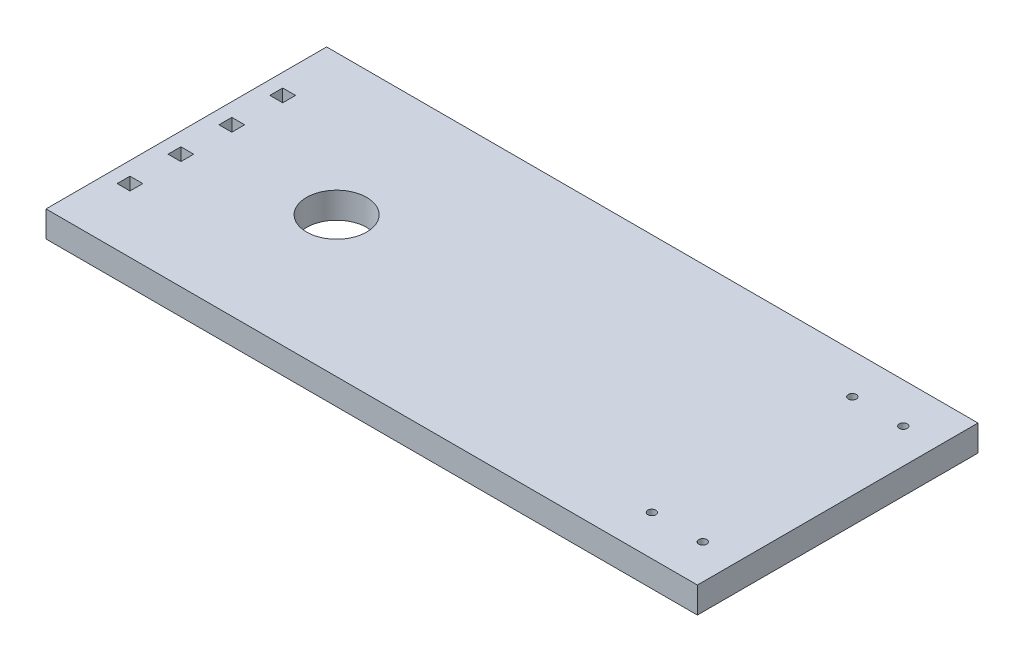
ISO-10303-21;
HEADER;
FILE_DESCRIPTION(('STEP AP214'),'2;1');
FILE_NAME('part.step','',(''),(''),'','','');
FILE_SCHEMA(('AUTOMOTIVE_DESIGN { 1 0 10303 214 1 1 1 1 }'));
ENDSEC;
DATA;
#1=APPLICATION_CONTEXT('core data for automotive mechanical design processes');
#2=APPLICATION_PROTOCOL_DEFINITION('international standard','automotive_design',2000,#1);
#3=PRODUCT_CONTEXT('',#1,'mechanical');
#4=PRODUCT('Part','Part','',(#3));
#5=PRODUCT_RELATED_PRODUCT_CATEGORY('part','',(#4));
#6=PRODUCT_DEFINITION_FORMATION('','',#4);
#7=PRODUCT_DEFINITION_CONTEXT('part definition',#1,'design');
#8=PRODUCT_DEFINITION('design','',#6,#7);
#9=PRODUCT_DEFINITION_SHAPE('','',#8);
#10=(LENGTH_UNIT() NAMED_UNIT(*) SI_UNIT(.MILLI.,.METRE.));
#11=(NAMED_UNIT(*) PLANE_ANGLE_UNIT() SI_UNIT($,.RADIAN.));
#12=(NAMED_UNIT(*) SI_UNIT($,.STERADIAN.) SOLID_ANGLE_UNIT());
#13=UNCERTAINTY_MEASURE_WITH_UNIT(LENGTH_MEASURE(1.E-05),#10,'distance_accuracy_value','');
#14=(GEOMETRIC_REPRESENTATION_CONTEXT(3) GLOBAL_UNCERTAINTY_ASSIGNED_CONTEXT((#13)) GLOBAL_UNIT_ASSIGNED_CONTEXT((#10,
#11,#12)) REPRESENTATION_CONTEXT('',''));
#15=CARTESIAN_POINT('',(0.,0.,0.));
#16=DIRECTION('',(0.,0.,1.));
#17=DIRECTION('',(1.,0.,0.));
#18=AXIS2_PLACEMENT_3D('',#15,#16,#17);
#19=CARTESIAN_POINT('',(16.25,1.3,7.));
#20=DIRECTION('',(-1.,0.,0.));
#21=DIRECTION('',(0.,0.,1.));
#22=AXIS2_PLACEMENT_3D('',#19,#20,#21);
#23=PLANE('',#22);
#24=DIRECTION('',(0.,0.,-1.));
#25=VECTOR('',#24,1.);
#26=CARTESIAN_POINT('',(16.25,0.,7.));
#27=LINE('',#26,#25);
#28=CARTESIAN_POINT('',(16.25,0.,7.));
#29=VERTEX_POINT('',#28);
#30=CARTESIAN_POINT('',(16.25,0.,-7.));
#31=VERTEX_POINT('',#30);
#32=EDGE_CURVE('E326',#29,#31,#27,.T.);
#33=ORIENTED_EDGE('',*,*,#32,.T.);
#34=DIRECTION('',(0.,-1.,0.));
#35=VECTOR('',#34,1.);
#36=CARTESIAN_POINT('',(16.25,1.3,-7.));
#37=LINE('',#36,#35);
#38=CARTESIAN_POINT('',(16.25,1.3,-7.));
#39=VERTEX_POINT('',#38);
#40=EDGE_CURVE('E11',#39,#31,#37,.T.);
#41=ORIENTED_EDGE('',*,*,#40,.F.);
#42=DIRECTION('',(0.,0.,-1.));
#43=VECTOR('',#42,1.);
#44=CARTESIAN_POINT('',(16.25,1.3,7.));
#45=LINE('',#44,#43);
#46=CARTESIAN_POINT('',(16.25,1.3,7.));
#47=VERTEX_POINT('',#46);
#48=EDGE_CURVE('E329',#47,#39,#45,.T.);
#49=ORIENTED_EDGE('',*,*,#48,.F.);
#50=DIRECTION('',(0.,-1.,0.));
#51=VECTOR('',#50,1.);
#52=CARTESIAN_POINT('',(16.25,1.3,7.));
#53=LINE('',#52,#51);
#54=EDGE_CURVE('E339',#47,#29,#53,.T.);
#55=ORIENTED_EDGE('',*,*,#54,.T.);
#56=EDGE_LOOP('',(#33,#41,#49,#55));
#57=FACE_BOUND('',#56,.T.);
#58=ADVANCED_FACE('F33',(#57),#23,.F.);
#59=CARTESIAN_POINT('',(-16.25,1.3,-7.));
#60=DIRECTION('',(0.,0.,1.));
#61=DIRECTION('',(1.,0.,0.));
#62=AXIS2_PLACEMENT_3D('',#59,#60,#61);
#63=PLANE('',#62);
#64=DIRECTION('',(-1.,0.,0.));
#65=VECTOR('',#64,1.);
#66=CARTESIAN_POINT('',(-16.25,0.,-7.));
#67=LINE('',#66,#65);
#68=CARTESIAN_POINT('',(-16.25,0.,-7.));
#69=VERTEX_POINT('',#68);
#70=EDGE_CURVE('E342',#31,#69,#67,.T.);
#71=ORIENTED_EDGE('',*,*,#70,.T.);
#72=DIRECTION('',(0.,-1.,0.));
#73=VECTOR('',#72,1.);
#74=CARTESIAN_POINT('',(-16.25,1.3,-7.));
#75=LINE('',#74,#73);
#76=CARTESIAN_POINT('',(-16.25,1.3,-7.));
#77=VERTEX_POINT('',#76);
#78=EDGE_CURVE('E41',#77,#69,#75,.T.);
#79=ORIENTED_EDGE('',*,*,#78,.F.);
#80=DIRECTION('',(-1.,0.,0.));
#81=VECTOR('',#80,1.);
#82=CARTESIAN_POINT('',(-16.25,1.3,-7.));
#83=LINE('',#82,#81);
#84=EDGE_CURVE('E332',#39,#77,#83,.T.);
#85=ORIENTED_EDGE('',*,*,#84,.F.);
#86=ORIENTED_EDGE('',*,*,#40,.T.);
#87=EDGE_LOOP('',(#71,#79,#85,#86));
#88=FACE_BOUND('',#87,.T.);
#89=ADVANCED_FACE('F372',(#88),#63,.F.);
#90=CARTESIAN_POINT('',(-16.25,1.3,7.));
#91=DIRECTION('',(1.,0.,0.));
#92=DIRECTION('',(0.,0.,-1.));
#93=AXIS2_PLACEMENT_3D('',#90,#91,#92);
#94=PLANE('',#93);
#95=DIRECTION('',(0.,0.,1.));
#96=VECTOR('',#95,1.);
#97=CARTESIAN_POINT('',(-16.25,0.,7.));
#98=LINE('',#97,#96);
#99=CARTESIAN_POINT('',(-16.25,0.,7.));
#100=VERTEX_POINT('',#99);
#101=EDGE_CURVE('E344',#69,#100,#98,.T.);
#102=ORIENTED_EDGE('',*,*,#101,.T.);
#103=DIRECTION('',(0.,-1.,0.));
#104=VECTOR('',#103,1.);
#105=CARTESIAN_POINT('',(-16.25,1.3,7.));
#106=LINE('',#105,#104);
#107=CARTESIAN_POINT('',(-16.25,1.3,7.));
#108=VERTEX_POINT('',#107);
#109=EDGE_CURVE('E349',#108,#100,#106,.T.);
#110=ORIENTED_EDGE('',*,*,#109,.F.);
#111=DIRECTION('',(0.,0.,1.));
#112=VECTOR('',#111,1.);
#113=CARTESIAN_POINT('',(-16.25,1.3,7.));
#114=LINE('',#113,#112);
#115=EDGE_CURVE('E335',#77,#108,#114,.T.);
#116=ORIENTED_EDGE('',*,*,#115,.F.);
#117=ORIENTED_EDGE('',*,*,#78,.T.);
#118=EDGE_LOOP('',(#102,#110,#116,#117));
#119=FACE_BOUND('',#118,.T.);
#120=ADVANCED_FACE('F357',(#119),#94,.F.);
#121=CARTESIAN_POINT('',(-16.25,1.3,7.));
#122=DIRECTION('',(0.,0.,-1.));
#123=DIRECTION('',(-1.,0.,0.));
#124=AXIS2_PLACEMENT_3D('',#121,#122,#123);
#125=PLANE('',#124);
#126=DIRECTION('',(1.,0.,0.));
#127=VECTOR('',#126,1.);
#128=CARTESIAN_POINT('',(-16.25,0.,7.));
#129=LINE('',#128,#127);
#130=EDGE_CURVE('E333',#100,#29,#129,.T.);
#131=ORIENTED_EDGE('',*,*,#130,.T.);
#132=ORIENTED_EDGE('',*,*,#54,.F.);
#133=DIRECTION('',(1.,0.,0.));
#134=VECTOR('',#133,1.);
#135=CARTESIAN_POINT('',(-16.25,1.3,7.));
#136=LINE('',#135,#134);
#137=EDGE_CURVE('E337',#108,#47,#136,.T.);
#138=ORIENTED_EDGE('',*,*,#137,.F.);
#139=ORIENTED_EDGE('',*,*,#109,.T.);
#140=EDGE_LOOP('',(#131,#132,#138,#139));
#141=FACE_BOUND('',#140,.T.);
#142=ADVANCED_FACE('F365',(#141),#125,.F.);
#143=CARTESIAN_POINT('',(0.,1.3,0.));
#144=DIRECTION('',(0.,-1.,0.));
#145=DIRECTION('',(0.,0.,-1.));
#146=AXIS2_PLACEMENT_3D('',#143,#144,#145);
#147=PLANE('',#146);
#148=CARTESIAN_POINT('',(-8.75000000000001,1.3,0.));
#149=DIRECTION('',(0.,1.,0.));
#150=DIRECTION('',(0.,0.,1.));
#151=AXIS2_PLACEMENT_3D('',#148,#149,#150);
#152=CIRCLE('',#151,1.5);
#153=CARTESIAN_POINT('',(-8.75000000000001,1.3,1.5));
#154=VERTEX_POINT('',#153);
#155=EDGE_CURVE('E194',#154,#154,#152,.T.);
#156=ORIENTED_EDGE('',*,*,#155,.F.);
#157=EDGE_LOOP('',(#156));
#158=FACE_BOUND('',#157,.T.);
#159=DIRECTION('',(-1.,0.,0.));
#160=VECTOR('',#159,1.);
#161=CARTESIAN_POINT('',(-15.57,1.3,3.49));
#162=LINE('',#161,#160);
#163=CARTESIAN_POINT('',(-14.93,1.3,3.49));
#164=VERTEX_POINT('',#163);
#165=CARTESIAN_POINT('',(-15.57,1.3,3.49));
#166=VERTEX_POINT('',#165);
#167=EDGE_CURVE('E199',#164,#166,#162,.T.);
#168=ORIENTED_EDGE('',*,*,#167,.F.);
#169=DIRECTION('',(0.,0.,-1.));
#170=VECTOR('',#169,1.);
#171=CARTESIAN_POINT('',(-14.93,1.3,3.49));
#172=LINE('',#171,#170);
#173=CARTESIAN_POINT('',(-14.93,1.3,4.13));
#174=VERTEX_POINT('',#173);
#175=EDGE_CURVE('E48',#174,#164,#172,.T.);
#176=ORIENTED_EDGE('',*,*,#175,.F.);
#177=DIRECTION('',(1.,0.,0.));
#178=VECTOR('',#177,1.);
#179=CARTESIAN_POINT('',(-15.57,1.3,4.13));
#180=LINE('',#179,#178);
#181=CARTESIAN_POINT('',(-15.57,1.3,4.13));
#182=VERTEX_POINT('',#181);
#183=EDGE_CURVE('E188',#182,#174,#180,.T.);
#184=ORIENTED_EDGE('',*,*,#183,.F.);
#185=DIRECTION('',(0.,0.,1.));
#186=VECTOR('',#185,1.);
#187=CARTESIAN_POINT('',(-15.57,1.3,3.49));
#188=LINE('',#187,#186);
#189=EDGE_CURVE('E191',#166,#182,#188,.T.);
#190=ORIENTED_EDGE('',*,*,#189,.F.);
#191=EDGE_LOOP('',(#168,#176,#184,#190));
#192=FACE_BOUND('',#191,.T.);
#193=DIRECTION('',(-1.,0.,0.));
#194=VECTOR('',#193,1.);
#195=CARTESIAN_POINT('',(-15.57,1.3,0.950000000000003));
#196=LINE('',#195,#194);
#197=CARTESIAN_POINT('',(-14.93,1.3,0.950000000000003));
#198=VERTEX_POINT('',#197);
#199=CARTESIAN_POINT('',(-15.57,1.3,0.950000000000003));
#200=VERTEX_POINT('',#199);
#201=EDGE_CURVE('E224',#198,#200,#196,.T.);
#202=ORIENTED_EDGE('',*,*,#201,.F.);
#203=DIRECTION('',(0.,0.,-1.));
#204=VECTOR('',#203,1.);
#205=CARTESIAN_POINT('',(-14.93,1.3,0.950000000000003));
#206=LINE('',#205,#204);
#207=CARTESIAN_POINT('',(-14.93,1.3,1.59));
#208=VERTEX_POINT('',#207);
#209=EDGE_CURVE('E205',#208,#198,#206,.T.);
#210=ORIENTED_EDGE('',*,*,#209,.F.);
#211=DIRECTION('',(1.,0.,0.));
#212=VECTOR('',#211,1.);
#213=CARTESIAN_POINT('',(-15.57,1.3,1.59));
#214=LINE('',#213,#212);
#215=CARTESIAN_POINT('',(-15.57,1.3,1.59));
#216=VERTEX_POINT('',#215);
#217=EDGE_CURVE('E213',#216,#208,#214,.T.);
#218=ORIENTED_EDGE('',*,*,#217,.F.);
#219=DIRECTION('',(0.,0.,1.));
#220=VECTOR('',#219,1.);
#221=CARTESIAN_POINT('',(-15.57,1.3,0.950000000000003));
#222=LINE('',#221,#220);
#223=EDGE_CURVE('E227',#200,#216,#222,.T.);
#224=ORIENTED_EDGE('',*,*,#223,.F.);
#225=EDGE_LOOP('',(#202,#210,#218,#224));
#226=FACE_BOUND('',#225,.T.);
#227=DIRECTION('',(-1.,0.,0.));
#228=VECTOR('',#227,1.);
#229=CARTESIAN_POINT('',(-15.57,1.3,-1.59));
#230=LINE('',#229,#228);
#231=CARTESIAN_POINT('',(-14.93,1.3,-1.59));
#232=VERTEX_POINT('',#231);
#233=CARTESIAN_POINT('',(-15.57,1.3,-1.59));
#234=VERTEX_POINT('',#233);
#235=EDGE_CURVE('E256',#232,#234,#230,.T.);
#236=ORIENTED_EDGE('',*,*,#235,.F.);
#237=DIRECTION('',(0.,0.,-1.));
#238=VECTOR('',#237,1.);
#239=CARTESIAN_POINT('',(-14.93,1.3,-1.59));
#240=LINE('',#239,#238);
#241=CARTESIAN_POINT('',(-14.93,1.3,-0.949999999999998));
#242=VERTEX_POINT('',#241);
#243=EDGE_CURVE('E234',#242,#232,#240,.T.);
#244=ORIENTED_EDGE('',*,*,#243,.F.);
#245=DIRECTION('',(1.,0.,0.));
#246=VECTOR('',#245,1.);
#247=CARTESIAN_POINT('',(-15.57,1.3,-0.949999999999998));
#248=LINE('',#247,#246);
#249=CARTESIAN_POINT('',(-15.57,1.3,-0.949999999999998));
#250=VERTEX_POINT('',#249);
#251=EDGE_CURVE('E245',#250,#242,#248,.T.);
#252=ORIENTED_EDGE('',*,*,#251,.F.);
#253=DIRECTION('',(0.,0.,1.));
#254=VECTOR('',#253,1.);
#255=CARTESIAN_POINT('',(-15.57,1.3,-1.59));
#256=LINE('',#255,#254);
#257=EDGE_CURVE('E259',#234,#250,#256,.T.);
#258=ORIENTED_EDGE('',*,*,#257,.F.);
#259=EDGE_LOOP('',(#236,#244,#252,#258));
#260=FACE_BOUND('',#259,.T.);
#261=DIRECTION('',(-1.,0.,0.));
#262=VECTOR('',#261,1.);
#263=CARTESIAN_POINT('',(-15.57,1.3,-4.13));
#264=LINE('',#263,#262);
#265=CARTESIAN_POINT('',(-14.93,1.3,-4.13));
#266=VERTEX_POINT('',#265);
#267=CARTESIAN_POINT('',(-15.57,1.3,-4.13));
#268=VERTEX_POINT('',#267);
#269=EDGE_CURVE('E288',#266,#268,#264,.T.);
#270=ORIENTED_EDGE('',*,*,#269,.F.);
#271=DIRECTION('',(0.,0.,-1.));
#272=VECTOR('',#271,1.);
#273=CARTESIAN_POINT('',(-14.93,1.3,-4.13));
#274=LINE('',#273,#272);
#275=CARTESIAN_POINT('',(-14.93,1.3,-3.49));
#276=VERTEX_POINT('',#275);
#277=EDGE_CURVE('E266',#276,#266,#274,.T.);
#278=ORIENTED_EDGE('',*,*,#277,.F.);
#279=DIRECTION('',(1.,0.,0.));
#280=VECTOR('',#279,1.);
#281=CARTESIAN_POINT('',(-15.57,1.3,-3.49));
#282=LINE('',#281,#280);
#283=CARTESIAN_POINT('',(-15.57,1.3,-3.49));
#284=VERTEX_POINT('',#283);
#285=EDGE_CURVE('E277',#284,#276,#282,.T.);
#286=ORIENTED_EDGE('',*,*,#285,.F.);
#287=DIRECTION('',(0.,0.,1.));
#288=VECTOR('',#287,1.);
#289=CARTESIAN_POINT('',(-15.57,1.3,-4.13));
#290=LINE('',#289,#288);
#291=EDGE_CURVE('E291',#268,#284,#290,.T.);
#292=ORIENTED_EDGE('',*,*,#291,.F.);
#293=EDGE_LOOP('',(#270,#278,#286,#292));
#294=FACE_BOUND('',#293,.T.);
#295=CARTESIAN_POINT('',(14.52,1.3,-5.));
#296=DIRECTION('',(0.,1.,0.));
#297=DIRECTION('',(0.,0.,-1.));
#298=AXIS2_PLACEMENT_3D('',#295,#296,#297);
#299=CIRCLE('',#298,0.200000000000001);
#300=CARTESIAN_POINT('',(14.52,1.3,-5.2));
#301=VERTEX_POINT('',#300);
#302=EDGE_CURVE('E298',#301,#301,#299,.T.);
#303=ORIENTED_EDGE('',*,*,#302,.F.);
#304=EDGE_LOOP('',(#303));
#305=FACE_BOUND('',#304,.T.);
#306=CARTESIAN_POINT('',(11.98,1.3,-5.));
#307=DIRECTION('',(0.,1.,0.));
#308=DIRECTION('',(0.,0.,-1.));
#309=AXIS2_PLACEMENT_3D('',#306,#307,#308);
#310=CIRCLE('',#309,0.200000000000001);
#311=CARTESIAN_POINT('',(11.98,1.3,-5.2));
#312=VERTEX_POINT('',#311);
#313=EDGE_CURVE('E308',#312,#312,#310,.T.);
#314=ORIENTED_EDGE('',*,*,#313,.F.);
#315=EDGE_LOOP('',(#314));
#316=FACE_BOUND('',#315,.T.);
#317=CARTESIAN_POINT('',(11.98,1.3,5.));
#318=DIRECTION('',(0.,1.,0.));
#319=DIRECTION('',(0.,0.,1.));
#320=AXIS2_PLACEMENT_3D('',#317,#318,#319);
#321=CIRCLE('',#320,0.200000000000001);
#322=CARTESIAN_POINT('',(11.98,1.3,5.2));
#323=VERTEX_POINT('',#322);
#324=EDGE_CURVE('E314',#323,#323,#321,.T.);
#325=ORIENTED_EDGE('',*,*,#324,.F.);
#326=EDGE_LOOP('',(#325));
#327=FACE_BOUND('',#326,.T.);
#328=CARTESIAN_POINT('',(14.52,1.3,5.));
#329=DIRECTION('',(0.,1.,0.));
#330=DIRECTION('',(0.,0.,1.));
#331=AXIS2_PLACEMENT_3D('',#328,#329,#330);
#332=CIRCLE('',#331,0.200000000000001);
#333=CARTESIAN_POINT('',(14.52,1.3,5.2));
#334=VERTEX_POINT('',#333);
#335=EDGE_CURVE('E320',#334,#334,#332,.T.);
#336=ORIENTED_EDGE('',*,*,#335,.F.);
#337=EDGE_LOOP('',(#336));
#338=FACE_BOUND('',#337,.T.);
#339=ORIENTED_EDGE('',*,*,#48,.T.);
#340=ORIENTED_EDGE('',*,*,#84,.T.);
#341=ORIENTED_EDGE('',*,*,#115,.T.);
#342=ORIENTED_EDGE('',*,*,#137,.T.);
#343=EDGE_LOOP('',(#339,#340,#341,#342));
#344=FACE_BOUND('',#343,.T.);
#345=ADVANCED_FACE('F371',(#158,#192,#226,#260,#294,#305,#316,#327,#338,#344),#147,.F.);
#346=CARTESIAN_POINT('',(0.,0.,0.));
#347=DIRECTION('',(0.,-1.,0.));
#348=DIRECTION('',(0.,0.,-1.));
#349=AXIS2_PLACEMENT_3D('',#346,#347,#348);
#350=PLANE('',#349);
#351=CARTESIAN_POINT('',(-8.75000000000001,0.,0.));
#352=DIRECTION('',(0.,-1.,0.));
#353=DIRECTION('',(0.,0.,-1.));
#354=AXIS2_PLACEMENT_3D('',#351,#352,#353);
#355=CIRCLE('',#354,1.5);
#356=CARTESIAN_POINT('',(-8.75000000000001,0.,-1.5));
#357=VERTEX_POINT('',#356);
#358=EDGE_CURVE('E36',#357,#357,#355,.T.);
#359=ORIENTED_EDGE('',*,*,#358,.F.);
#360=EDGE_LOOP('',(#359));
#361=FACE_BOUND('',#360,.T.);
#362=DIRECTION('',(0.,0.,-1.));
#363=VECTOR('',#362,1.);
#364=CARTESIAN_POINT('',(-14.93,0.,3.49));
#365=LINE('',#364,#363);
#366=CARTESIAN_POINT('',(-14.93,0.,4.13));
#367=VERTEX_POINT('',#366);
#368=CARTESIAN_POINT('',(-14.93,0.,3.49));
#369=VERTEX_POINT('',#368);
#370=EDGE_CURVE('E172',#367,#369,#365,.T.);
#371=ORIENTED_EDGE('',*,*,#370,.T.);
#372=DIRECTION('',(-1.,0.,0.));
#373=VECTOR('',#372,1.);
#374=CARTESIAN_POINT('',(-15.57,0.,3.49));
#375=LINE('',#374,#373);
#376=CARTESIAN_POINT('',(-15.57,0.,3.49));
#377=VERTEX_POINT('',#376);
#378=EDGE_CURVE('E181',#369,#377,#375,.T.);
#379=ORIENTED_EDGE('',*,*,#378,.T.);
#380=DIRECTION('',(0.,0.,1.));
#381=VECTOR('',#380,1.);
#382=CARTESIAN_POINT('',(-15.57,0.,3.49));
#383=LINE('',#382,#381);
#384=CARTESIAN_POINT('',(-15.57,0.,4.13));
#385=VERTEX_POINT('',#384);
#386=EDGE_CURVE('E56',#377,#385,#383,.T.);
#387=ORIENTED_EDGE('',*,*,#386,.T.);
#388=DIRECTION('',(1.,0.,0.));
#389=VECTOR('',#388,1.);
#390=CARTESIAN_POINT('',(-15.57,0.,4.13));
#391=LINE('',#390,#389);
#392=EDGE_CURVE('E178',#385,#367,#391,.T.);
#393=ORIENTED_EDGE('',*,*,#392,.T.);
#394=EDGE_LOOP('',(#371,#379,#387,#393));
#395=FACE_BOUND('',#394,.T.);
#396=DIRECTION('',(0.,0.,-1.));
#397=VECTOR('',#396,1.);
#398=CARTESIAN_POINT('',(-14.93,0.,0.950000000000003));
#399=LINE('',#398,#397);
#400=CARTESIAN_POINT('',(-14.93,0.,1.59));
#401=VERTEX_POINT('',#400);
#402=CARTESIAN_POINT('',(-14.93,0.,0.950000000000003));
#403=VERTEX_POINT('',#402);
#404=EDGE_CURVE('E209',#401,#403,#399,.T.);
#405=ORIENTED_EDGE('',*,*,#404,.T.);
#406=DIRECTION('',(-1.,0.,0.));
#407=VECTOR('',#406,1.);
#408=CARTESIAN_POINT('',(-15.57,0.,0.950000000000003));
#409=LINE('',#408,#407);
#410=CARTESIAN_POINT('',(-15.57,0.,0.950000000000003));
#411=VERTEX_POINT('',#410);
#412=EDGE_CURVE('E212',#403,#411,#409,.T.);
#413=ORIENTED_EDGE('',*,*,#412,.T.);
#414=DIRECTION('',(0.,0.,1.));
#415=VECTOR('',#414,1.);
#416=CARTESIAN_POINT('',(-15.57,0.,0.950000000000003));
#417=LINE('',#416,#415);
#418=CARTESIAN_POINT('',(-15.57,0.,1.59));
#419=VERTEX_POINT('',#418);
#420=EDGE_CURVE('E216',#411,#419,#417,.T.);
#421=ORIENTED_EDGE('',*,*,#420,.T.);
#422=DIRECTION('',(1.,0.,0.));
#423=VECTOR('',#422,1.);
#424=CARTESIAN_POINT('',(-15.57,0.,1.59));
#425=LINE('',#424,#423);
#426=EDGE_CURVE('E219',#419,#401,#425,.T.);
#427=ORIENTED_EDGE('',*,*,#426,.T.);
#428=EDGE_LOOP('',(#405,#413,#421,#427));
#429=FACE_BOUND('',#428,.T.);
#430=DIRECTION('',(0.,0.,-1.));
#431=VECTOR('',#430,1.);
#432=CARTESIAN_POINT('',(-14.93,0.,-1.59));
#433=LINE('',#432,#431);
#434=CARTESIAN_POINT('',(-14.93,0.,-0.949999999999998));
#435=VERTEX_POINT('',#434);
#436=CARTESIAN_POINT('',(-14.93,0.,-1.59));
#437=VERTEX_POINT('',#436);
#438=EDGE_CURVE('E241',#435,#437,#433,.T.);
#439=ORIENTED_EDGE('',*,*,#438,.T.);
#440=DIRECTION('',(-1.,0.,0.));
#441=VECTOR('',#440,1.);
#442=CARTESIAN_POINT('',(-15.57,0.,-1.59));
#443=LINE('',#442,#441);
#444=CARTESIAN_POINT('',(-15.57,0.,-1.59));
#445=VERTEX_POINT('',#444);
#446=EDGE_CURVE('E244',#437,#445,#443,.T.);
#447=ORIENTED_EDGE('',*,*,#446,.T.);
#448=DIRECTION('',(0.,0.,1.));
#449=VECTOR('',#448,1.);
#450=CARTESIAN_POINT('',(-15.57,0.,-1.59));
#451=LINE('',#450,#449);
#452=CARTESIAN_POINT('',(-15.57,0.,-0.949999999999998));
#453=VERTEX_POINT('',#452);
#454=EDGE_CURVE('E248',#445,#453,#451,.T.);
#455=ORIENTED_EDGE('',*,*,#454,.T.);
#456=DIRECTION('',(1.,0.,0.));
#457=VECTOR('',#456,1.);
#458=CARTESIAN_POINT('',(-15.57,0.,-0.949999999999998));
#459=LINE('',#458,#457);
#460=EDGE_CURVE('E251',#453,#435,#459,.T.);
#461=ORIENTED_EDGE('',*,*,#460,.T.);
#462=EDGE_LOOP('',(#439,#447,#455,#461));
#463=FACE_BOUND('',#462,.T.);
#464=DIRECTION('',(0.,0.,-1.));
#465=VECTOR('',#464,1.);
#466=CARTESIAN_POINT('',(-14.93,0.,-4.13));
#467=LINE('',#466,#465);
#468=CARTESIAN_POINT('',(-14.93,0.,-3.49));
#469=VERTEX_POINT('',#468);
#470=CARTESIAN_POINT('',(-14.93,0.,-4.13));
#471=VERTEX_POINT('',#470);
#472=EDGE_CURVE('E273',#469,#471,#467,.T.);
#473=ORIENTED_EDGE('',*,*,#472,.T.);
#474=DIRECTION('',(-1.,0.,0.));
#475=VECTOR('',#474,1.);
#476=CARTESIAN_POINT('',(-15.57,0.,-4.13));
#477=LINE('',#476,#475);
#478=CARTESIAN_POINT('',(-15.57,0.,-4.13));
#479=VERTEX_POINT('',#478);
#480=EDGE_CURVE('E276',#471,#479,#477,.T.);
#481=ORIENTED_EDGE('',*,*,#480,.T.);
#482=DIRECTION('',(0.,0.,1.));
#483=VECTOR('',#482,1.);
#484=CARTESIAN_POINT('',(-15.57,0.,-4.13));
#485=LINE('',#484,#483);
#486=CARTESIAN_POINT('',(-15.57,0.,-3.49));
#487=VERTEX_POINT('',#486);
#488=EDGE_CURVE('E280',#479,#487,#485,.T.);
#489=ORIENTED_EDGE('',*,*,#488,.T.);
#490=DIRECTION('',(1.,0.,0.));
#491=VECTOR('',#490,1.);
#492=CARTESIAN_POINT('',(-15.57,0.,-3.49));
#493=LINE('',#492,#491);
#494=EDGE_CURVE('E283',#487,#469,#493,.T.);
#495=ORIENTED_EDGE('',*,*,#494,.T.);
#496=EDGE_LOOP('',(#473,#481,#489,#495));
#497=FACE_BOUND('',#496,.T.);
#498=CARTESIAN_POINT('',(14.52,0.,-5.));
#499=DIRECTION('',(0.,1.,0.));
#500=DIRECTION('',(0.,0.,-1.));
#501=AXIS2_PLACEMENT_3D('',#498,#499,#500);
#502=CIRCLE('',#501,0.200000000000001);
#503=CARTESIAN_POINT('',(14.52,0.,-5.2));
#504=VERTEX_POINT('',#503);
#505=EDGE_CURVE('E305',#504,#504,#502,.T.);
#506=ORIENTED_EDGE('',*,*,#505,.T.);
#507=EDGE_LOOP('',(#506));
#508=FACE_BOUND('',#507,.T.);
#509=CARTESIAN_POINT('',(11.98,0.,-5.));
#510=DIRECTION('',(0.,1.,0.));
#511=DIRECTION('',(0.,0.,-1.));
#512=AXIS2_PLACEMENT_3D('',#509,#510,#511);
#513=CIRCLE('',#512,0.200000000000001);
#514=CARTESIAN_POINT('',(11.98,0.,-5.2));
#515=VERTEX_POINT('',#514);
#516=EDGE_CURVE('E311',#515,#515,#513,.T.);
#517=ORIENTED_EDGE('',*,*,#516,.T.);
#518=EDGE_LOOP('',(#517));
#519=FACE_BOUND('',#518,.T.);
#520=CARTESIAN_POINT('',(11.98,0.,5.));
#521=DIRECTION('',(0.,1.,0.));
#522=DIRECTION('',(0.,0.,1.));
#523=AXIS2_PLACEMENT_3D('',#520,#521,#522);
#524=CIRCLE('',#523,0.200000000000001);
#525=CARTESIAN_POINT('',(11.98,0.,5.2));
#526=VERTEX_POINT('',#525);
#527=EDGE_CURVE('E317',#526,#526,#524,.T.);
#528=ORIENTED_EDGE('',*,*,#527,.T.);
#529=EDGE_LOOP('',(#528));
#530=FACE_BOUND('',#529,.T.);
#531=CARTESIAN_POINT('',(14.52,0.,5.));
#532=DIRECTION('',(0.,1.,0.));
#533=DIRECTION('',(0.,0.,1.));
#534=AXIS2_PLACEMENT_3D('',#531,#532,#533);
#535=CIRCLE('',#534,0.200000000000001);
#536=CARTESIAN_POINT('',(14.52,0.,5.2));
#537=VERTEX_POINT('',#536);
#538=EDGE_CURVE('E323',#537,#537,#535,.T.);
#539=ORIENTED_EDGE('',*,*,#538,.T.);
#540=EDGE_LOOP('',(#539));
#541=FACE_BOUND('',#540,.T.);
#542=ORIENTED_EDGE('',*,*,#32,.F.);
#543=ORIENTED_EDGE('',*,*,#130,.F.);
#544=ORIENTED_EDGE('',*,*,#101,.F.);
#545=ORIENTED_EDGE('',*,*,#70,.F.);
#546=EDGE_LOOP('',(#542,#543,#544,#545));
#547=FACE_BOUND('',#546,.T.);
#548=ADVANCED_FACE('F185',(#361,#395,#429,#463,#497,#508,#519,#530,#541,#547),#350,.T.);
#549=CARTESIAN_POINT('',(14.52,0.,5.));
#550=DIRECTION('',(0.,1.,0.));
#551=DIRECTION('',(0.,0.,1.));
#552=AXIS2_PLACEMENT_3D('',#549,#550,#551);
#553=CYLINDRICAL_SURFACE('',#552,0.200000000000001);
#554=ORIENTED_EDGE('',*,*,#538,.F.);
#555=EDGE_LOOP('',(#554));
#556=FACE_BOUND('',#555,.T.);
#557=ORIENTED_EDGE('',*,*,#335,.T.);
#558=EDGE_LOOP('',(#557));
#559=FACE_BOUND('',#558,.T.);
#560=ADVANCED_FACE('F384',(#556,#559),#553,.F.);
#561=CARTESIAN_POINT('',(11.98,0.,5.));
#562=DIRECTION('',(0.,1.,0.));
#563=DIRECTION('',(0.,0.,1.));
#564=AXIS2_PLACEMENT_3D('',#561,#562,#563);
#565=CYLINDRICAL_SURFACE('',#564,0.200000000000001);
#566=ORIENTED_EDGE('',*,*,#527,.F.);
#567=EDGE_LOOP('',(#566));
#568=FACE_BOUND('',#567,.T.);
#569=ORIENTED_EDGE('',*,*,#324,.T.);
#570=EDGE_LOOP('',(#569));
#571=FACE_BOUND('',#570,.T.);
#572=ADVANCED_FACE('F391',(#568,#571),#565,.F.);
#573=CARTESIAN_POINT('',(11.98,0.,-5.));
#574=DIRECTION('',(0.,1.,0.));
#575=DIRECTION('',(0.,0.,1.));
#576=AXIS2_PLACEMENT_3D('',#573,#574,#575);
#577=CYLINDRICAL_SURFACE('',#576,0.200000000000001);
#578=ORIENTED_EDGE('',*,*,#516,.F.);
#579=EDGE_LOOP('',(#578));
#580=FACE_BOUND('',#579,.T.);
#581=ORIENTED_EDGE('',*,*,#313,.T.);
#582=EDGE_LOOP('',(#581));
#583=FACE_BOUND('',#582,.T.);
#584=ADVANCED_FACE('F395',(#580,#583),#577,.F.);
#585=CARTESIAN_POINT('',(14.52,0.,-5.));
#586=DIRECTION('',(0.,1.,0.));
#587=DIRECTION('',(0.,0.,1.));
#588=AXIS2_PLACEMENT_3D('',#585,#586,#587);
#589=CYLINDRICAL_SURFACE('',#588,0.200000000000001);
#590=ORIENTED_EDGE('',*,*,#505,.F.);
#591=EDGE_LOOP('',(#590));
#592=FACE_BOUND('',#591,.T.);
#593=ORIENTED_EDGE('',*,*,#302,.T.);
#594=EDGE_LOOP('',(#593));
#595=FACE_BOUND('',#594,.T.);
#596=ADVANCED_FACE('F399',(#592,#595),#589,.F.);
#597=CARTESIAN_POINT('',(-14.93,0.,-4.13));
#598=DIRECTION('',(1.,0.,0.));
#599=DIRECTION('',(0.,0.,-1.));
#600=AXIS2_PLACEMENT_3D('',#597,#598,#599);
#601=PLANE('',#600);
#602=ORIENTED_EDGE('',*,*,#277,.T.);
#603=DIRECTION('',(0.,1.,0.));
#604=VECTOR('',#603,1.);
#605=CARTESIAN_POINT('',(-14.93,0.,-4.13));
#606=LINE('',#605,#604);
#607=EDGE_CURVE('E286',#471,#266,#606,.T.);
#608=ORIENTED_EDGE('',*,*,#607,.F.);
#609=ORIENTED_EDGE('',*,*,#472,.F.);
#610=DIRECTION('',(0.,1.,0.));
#611=VECTOR('',#610,1.);
#612=CARTESIAN_POINT('',(-14.93,0.,-3.49));
#613=LINE('',#612,#611);
#614=EDGE_CURVE('E296',#469,#276,#613,.T.);
#615=ORIENTED_EDGE('',*,*,#614,.T.);
#616=EDGE_LOOP('',(#602,#608,#609,#615));
#617=FACE_BOUND('',#616,.T.);
#618=ADVANCED_FACE('F403',(#617),#601,.F.);
#619=CARTESIAN_POINT('',(-15.57,0.,-3.49));
#620=DIRECTION('',(0.,0.,1.));
#621=DIRECTION('',(1.,0.,0.));
#622=AXIS2_PLACEMENT_3D('',#619,#620,#621);
#623=PLANE('',#622);
#624=ORIENTED_EDGE('',*,*,#285,.T.);
#625=ORIENTED_EDGE('',*,*,#614,.F.);
#626=ORIENTED_EDGE('',*,*,#494,.F.);
#627=DIRECTION('',(0.,1.,0.));
#628=VECTOR('',#627,1.);
#629=CARTESIAN_POINT('',(-15.57,0.,-3.49));
#630=LINE('',#629,#628);
#631=EDGE_CURVE('E299',#487,#284,#630,.T.);
#632=ORIENTED_EDGE('',*,*,#631,.T.);
#633=EDGE_LOOP('',(#624,#625,#626,#632));
#634=FACE_BOUND('',#633,.T.);
#635=ADVANCED_FACE('F407',(#634),#623,.F.);
#636=CARTESIAN_POINT('',(-15.57,0.,-4.13));
#637=DIRECTION('',(-1.,0.,0.));
#638=DIRECTION('',(0.,0.,1.));
#639=AXIS2_PLACEMENT_3D('',#636,#637,#638);
#640=PLANE('',#639);
#641=ORIENTED_EDGE('',*,*,#291,.T.);
#642=ORIENTED_EDGE('',*,*,#631,.F.);
#643=ORIENTED_EDGE('',*,*,#488,.F.);
#644=DIRECTION('',(0.,1.,0.));
#645=VECTOR('',#644,1.);
#646=CARTESIAN_POINT('',(-15.57,0.,-4.13));
#647=LINE('',#646,#645);
#648=EDGE_CURVE('E301',#479,#268,#647,.T.);
#649=ORIENTED_EDGE('',*,*,#648,.T.);
#650=EDGE_LOOP('',(#641,#642,#643,#649));
#651=FACE_BOUND('',#650,.T.);
#652=ADVANCED_FACE('F413',(#651),#640,.F.);
#653=CARTESIAN_POINT('',(-15.57,0.,-4.13));
#654=DIRECTION('',(0.,0.,-1.));
#655=DIRECTION('',(-1.,0.,0.));
#656=AXIS2_PLACEMENT_3D('',#653,#654,#655);
#657=PLANE('',#656);
#658=ORIENTED_EDGE('',*,*,#269,.T.);
#659=ORIENTED_EDGE('',*,*,#648,.F.);
#660=ORIENTED_EDGE('',*,*,#480,.F.);
#661=ORIENTED_EDGE('',*,*,#607,.T.);
#662=EDGE_LOOP('',(#658,#659,#660,#661));
#663=FACE_BOUND('',#662,.T.);
#664=ADVANCED_FACE('F409',(#663),#657,.F.);
#665=CARTESIAN_POINT('',(-14.93,0.,-1.59));
#666=DIRECTION('',(1.,0.,0.));
#667=DIRECTION('',(0.,0.,-1.));
#668=AXIS2_PLACEMENT_3D('',#665,#666,#667);
#669=PLANE('',#668);
#670=ORIENTED_EDGE('',*,*,#243,.T.);
#671=DIRECTION('',(0.,1.,0.));
#672=VECTOR('',#671,1.);
#673=CARTESIAN_POINT('',(-14.93,0.,-1.59));
#674=LINE('',#673,#672);
#675=EDGE_CURVE('E254',#437,#232,#674,.T.);
#676=ORIENTED_EDGE('',*,*,#675,.F.);
#677=ORIENTED_EDGE('',*,*,#438,.F.);
#678=DIRECTION('',(0.,1.,0.));
#679=VECTOR('',#678,1.);
#680=CARTESIAN_POINT('',(-14.93,0.,-0.949999999999998));
#681=LINE('',#680,#679);
#682=EDGE_CURVE('E264',#435,#242,#681,.T.);
#683=ORIENTED_EDGE('',*,*,#682,.T.);
#684=EDGE_LOOP('',(#670,#676,#677,#683));
#685=FACE_BOUND('',#684,.T.);
#686=ADVANCED_FACE('F412',(#685),#669,.F.);
#687=CARTESIAN_POINT('',(-15.57,0.,-0.949999999999998));
#688=DIRECTION('',(0.,0.,1.));
#689=DIRECTION('',(1.,0.,0.));
#690=AXIS2_PLACEMENT_3D('',#687,#688,#689);
#691=PLANE('',#690);
#692=ORIENTED_EDGE('',*,*,#251,.T.);
#693=ORIENTED_EDGE('',*,*,#682,.F.);
#694=ORIENTED_EDGE('',*,*,#460,.F.);
#695=DIRECTION('',(0.,1.,0.));
#696=VECTOR('',#695,1.);
#697=CARTESIAN_POINT('',(-15.57,0.,-0.949999999999998));
#698=LINE('',#697,#696);
#699=EDGE_CURVE('E267',#453,#250,#698,.T.);
#700=ORIENTED_EDGE('',*,*,#699,.T.);
#701=EDGE_LOOP('',(#692,#693,#694,#700));
#702=FACE_BOUND('',#701,.T.);
#703=ADVANCED_FACE('F423',(#702),#691,.F.);
#704=CARTESIAN_POINT('',(-15.57,0.,-1.59));
#705=DIRECTION('',(-1.,0.,0.));
#706=DIRECTION('',(0.,0.,1.));
#707=AXIS2_PLACEMENT_3D('',#704,#705,#706);
#708=PLANE('',#707);
#709=ORIENTED_EDGE('',*,*,#257,.T.);
#710=ORIENTED_EDGE('',*,*,#699,.F.);
#711=ORIENTED_EDGE('',*,*,#454,.F.);
#712=DIRECTION('',(0.,1.,0.));
#713=VECTOR('',#712,1.);
#714=CARTESIAN_POINT('',(-15.57,0.,-1.59));
#715=LINE('',#714,#713);
#716=EDGE_CURVE('E269',#445,#234,#715,.T.);
#717=ORIENTED_EDGE('',*,*,#716,.T.);
#718=EDGE_LOOP('',(#709,#710,#711,#717));
#719=FACE_BOUND('',#718,.T.);
#720=ADVANCED_FACE('F429',(#719),#708,.F.);
#721=CARTESIAN_POINT('',(-15.57,0.,-1.59));
#722=DIRECTION('',(0.,0.,-1.));
#723=DIRECTION('',(-1.,0.,0.));
#724=AXIS2_PLACEMENT_3D('',#721,#722,#723);
#725=PLANE('',#724);
#726=ORIENTED_EDGE('',*,*,#235,.T.);
#727=ORIENTED_EDGE('',*,*,#716,.F.);
#728=ORIENTED_EDGE('',*,*,#446,.F.);
#729=ORIENTED_EDGE('',*,*,#675,.T.);
#730=EDGE_LOOP('',(#726,#727,#728,#729));
#731=FACE_BOUND('',#730,.T.);
#732=ADVANCED_FACE('F425',(#731),#725,.F.);
#733=CARTESIAN_POINT('',(-14.93,0.,0.950000000000003));
#734=DIRECTION('',(1.,0.,0.));
#735=DIRECTION('',(0.,0.,-1.));
#736=AXIS2_PLACEMENT_3D('',#733,#734,#735);
#737=PLANE('',#736);
#738=ORIENTED_EDGE('',*,*,#209,.T.);
#739=DIRECTION('',(0.,1.,0.));
#740=VECTOR('',#739,1.);
#741=CARTESIAN_POINT('',(-14.93,0.,0.950000000000003));
#742=LINE('',#741,#740);
#743=EDGE_CURVE('E222',#403,#198,#742,.T.);
#744=ORIENTED_EDGE('',*,*,#743,.F.);
#745=ORIENTED_EDGE('',*,*,#404,.F.);
#746=DIRECTION('',(0.,1.,0.));
#747=VECTOR('',#746,1.);
#748=CARTESIAN_POINT('',(-14.93,0.,1.59));
#749=LINE('',#748,#747);
#750=EDGE_CURVE('E232',#401,#208,#749,.T.);
#751=ORIENTED_EDGE('',*,*,#750,.T.);
#752=EDGE_LOOP('',(#738,#744,#745,#751));
#753=FACE_BOUND('',#752,.T.);
#754=ADVANCED_FACE('F428',(#753),#737,.F.);
#755=CARTESIAN_POINT('',(-15.57,0.,1.59));
#756=DIRECTION('',(0.,0.,1.));
#757=DIRECTION('',(1.,0.,0.));
#758=AXIS2_PLACEMENT_3D('',#755,#756,#757);
#759=PLANE('',#758);
#760=ORIENTED_EDGE('',*,*,#217,.T.);
#761=ORIENTED_EDGE('',*,*,#750,.F.);
#762=ORIENTED_EDGE('',*,*,#426,.F.);
#763=DIRECTION('',(0.,1.,0.));
#764=VECTOR('',#763,1.);
#765=CARTESIAN_POINT('',(-15.57,0.,1.59));
#766=LINE('',#765,#764);
#767=EDGE_CURVE('E235',#419,#216,#766,.T.);
#768=ORIENTED_EDGE('',*,*,#767,.T.);
#769=EDGE_LOOP('',(#760,#761,#762,#768));
#770=FACE_BOUND('',#769,.T.);
#771=ADVANCED_FACE('F439',(#770),#759,.F.);
#772=CARTESIAN_POINT('',(-15.57,0.,0.950000000000003));
#773=DIRECTION('',(-1.,0.,0.));
#774=DIRECTION('',(0.,0.,1.));
#775=AXIS2_PLACEMENT_3D('',#772,#773,#774);
#776=PLANE('',#775);
#777=ORIENTED_EDGE('',*,*,#223,.T.);
#778=ORIENTED_EDGE('',*,*,#767,.F.);
#779=ORIENTED_EDGE('',*,*,#420,.F.);
#780=DIRECTION('',(0.,1.,0.));
#781=VECTOR('',#780,1.);
#782=CARTESIAN_POINT('',(-15.57,0.,0.950000000000003));
#783=LINE('',#782,#781);
#784=EDGE_CURVE('E237',#411,#200,#783,.T.);
#785=ORIENTED_EDGE('',*,*,#784,.T.);
#786=EDGE_LOOP('',(#777,#778,#779,#785));
#787=FACE_BOUND('',#786,.T.);
#788=ADVANCED_FACE('F444',(#787),#776,.F.);
#789=CARTESIAN_POINT('',(-15.57,0.,0.950000000000003));
#790=DIRECTION('',(0.,0.,-1.));
#791=DIRECTION('',(-1.,0.,0.));
#792=AXIS2_PLACEMENT_3D('',#789,#790,#791);
#793=PLANE('',#792);
#794=ORIENTED_EDGE('',*,*,#201,.T.);
#795=ORIENTED_EDGE('',*,*,#784,.F.);
#796=ORIENTED_EDGE('',*,*,#412,.F.);
#797=ORIENTED_EDGE('',*,*,#743,.T.);
#798=EDGE_LOOP('',(#794,#795,#796,#797));
#799=FACE_BOUND('',#798,.T.);
#800=ADVANCED_FACE('F441',(#799),#793,.F.);
#801=CARTESIAN_POINT('',(-14.93,0.,3.49));
#802=DIRECTION('',(1.,0.,0.));
#803=DIRECTION('',(0.,0.,-1.));
#804=AXIS2_PLACEMENT_3D('',#801,#802,#803);
#805=PLANE('',#804);
#806=ORIENTED_EDGE('',*,*,#175,.T.);
#807=DIRECTION('',(0.,1.,0.));
#808=VECTOR('',#807,1.);
#809=CARTESIAN_POINT('',(-14.93,0.,3.49));
#810=LINE('',#809,#808);
#811=EDGE_CURVE('E168',#369,#164,#810,.T.);
#812=ORIENTED_EDGE('',*,*,#811,.F.);
#813=ORIENTED_EDGE('',*,*,#370,.F.);
#814=DIRECTION('',(0.,1.,0.));
#815=VECTOR('',#814,1.);
#816=CARTESIAN_POINT('',(-14.93,0.,4.13));
#817=LINE('',#816,#815);
#818=EDGE_CURVE('E203',#367,#174,#817,.T.);
#819=ORIENTED_EDGE('',*,*,#818,.T.);
#820=EDGE_LOOP('',(#806,#812,#813,#819));
#821=FACE_BOUND('',#820,.T.);
#822=ADVANCED_FACE('F170',(#821),#805,.F.);
#823=CARTESIAN_POINT('',(-15.57,0.,4.13));
#824=DIRECTION('',(0.,0.,1.));
#825=DIRECTION('',(1.,0.,0.));
#826=AXIS2_PLACEMENT_3D('',#823,#824,#825);
#827=PLANE('',#826);
#828=ORIENTED_EDGE('',*,*,#183,.T.);
#829=ORIENTED_EDGE('',*,*,#818,.F.);
#830=ORIENTED_EDGE('',*,*,#392,.F.);
#831=DIRECTION('',(0.,1.,0.));
#832=VECTOR('',#831,1.);
#833=CARTESIAN_POINT('',(-15.57,0.,4.13));
#834=LINE('',#833,#832);
#835=EDGE_CURVE('E206',#385,#182,#834,.T.);
#836=ORIENTED_EDGE('',*,*,#835,.T.);
#837=EDGE_LOOP('',(#828,#829,#830,#836));
#838=FACE_BOUND('',#837,.T.);
#839=ADVANCED_FACE('F454',(#838),#827,.F.);
#840=CARTESIAN_POINT('',(-15.57,0.,3.49));
#841=DIRECTION('',(-1.,0.,0.));
#842=DIRECTION('',(0.,0.,1.));
#843=AXIS2_PLACEMENT_3D('',#840,#841,#842);
#844=PLANE('',#843);
#845=ORIENTED_EDGE('',*,*,#189,.T.);
#846=ORIENTED_EDGE('',*,*,#835,.F.);
#847=ORIENTED_EDGE('',*,*,#386,.F.);
#848=DIRECTION('',(0.,1.,0.));
#849=VECTOR('',#848,1.);
#850=CARTESIAN_POINT('',(-15.57,0.,3.49));
#851=LINE('',#850,#849);
#852=EDGE_CURVE('E177',#377,#166,#851,.T.);
#853=ORIENTED_EDGE('',*,*,#852,.T.);
#854=EDGE_LOOP('',(#845,#846,#847,#853));
#855=FACE_BOUND('',#854,.T.);
#856=ADVANCED_FACE('F458',(#855),#844,.F.);
#857=CARTESIAN_POINT('',(-15.57,0.,3.49));
#858=DIRECTION('',(0.,0.,-1.));
#859=DIRECTION('',(-1.,0.,0.));
#860=AXIS2_PLACEMENT_3D('',#857,#858,#859);
#861=PLANE('',#860);
#862=ORIENTED_EDGE('',*,*,#167,.T.);
#863=ORIENTED_EDGE('',*,*,#852,.F.);
#864=ORIENTED_EDGE('',*,*,#378,.F.);
#865=ORIENTED_EDGE('',*,*,#811,.T.);
#866=EDGE_LOOP('',(#862,#863,#864,#865));
#867=FACE_BOUND('',#866,.T.);
#868=ADVANCED_FACE('F182',(#867),#861,.F.);
#869=CARTESIAN_POINT('',(-8.75000000000001,-8.7,0.));
#870=DIRECTION('',(0.,1.,0.));
#871=DIRECTION('',(0.,0.,1.));
#872=AXIS2_PLACEMENT_3D('',#869,#870,#871);
#873=CYLINDRICAL_SURFACE('',#872,1.5);
#874=ORIENTED_EDGE('',*,*,#358,.T.);
#875=EDGE_LOOP('',(#874));
#876=FACE_BOUND('',#875,.T.);
#877=ORIENTED_EDGE('',*,*,#155,.T.);
#878=EDGE_LOOP('',(#877));
#879=FACE_BOUND('',#878,.T.);
#880=ADVANCED_FACE('F457',(#876,#879),#873,.F.);
#881=CLOSED_SHELL('',(#58,#89,#120,#142,#345,#548,#560,#572,#584,#596,#618,#635,#652,#664,#686,
#703,#720,#732,#754,#771,#788,#800,#822,#839,#856,#868,#880));
#882=MANIFOLD_SOLID_BREP('B2',#881);
#883=ADVANCED_BREP_SHAPE_REPRESENTATION('',(#18,#882),#14);
#884=SHAPE_DEFINITION_REPRESENTATION(#9,#883);
ENDSEC;
END-ISO-10303-21;
